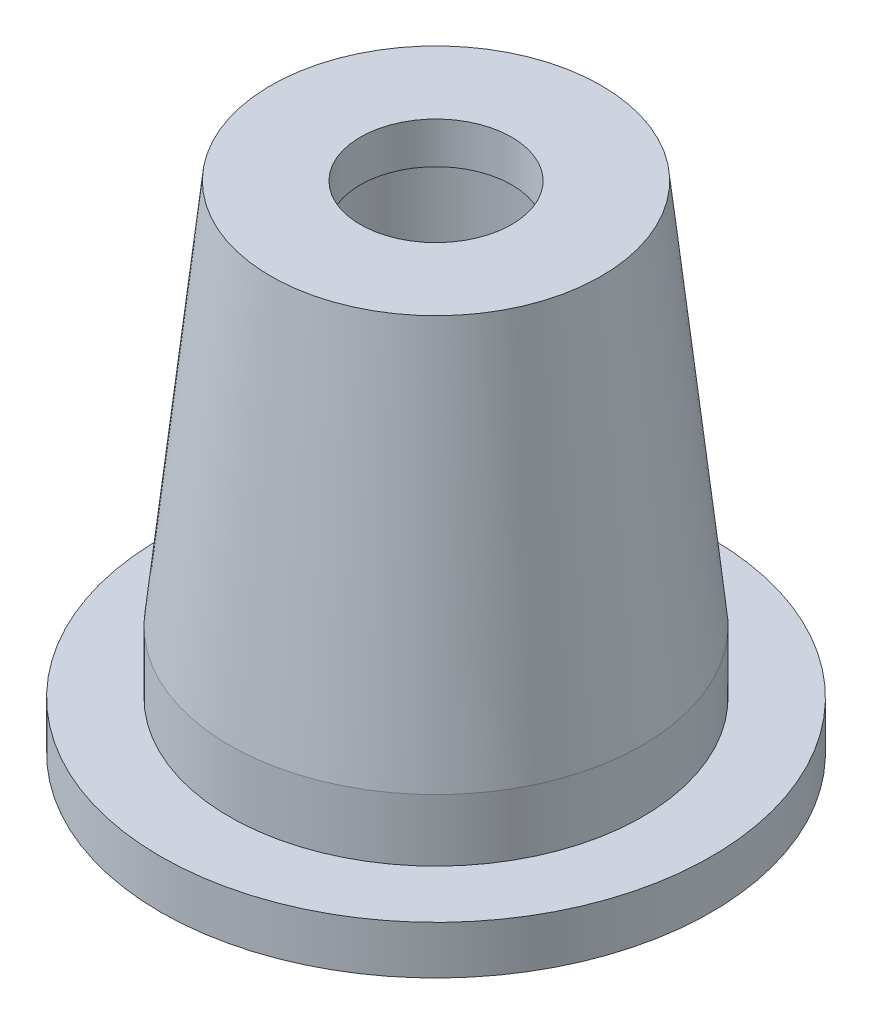
ISO-10303-21;
HEADER;
FILE_DESCRIPTION(('STEP AP214'),'2;1');
FILE_NAME('part.step','',(''),(''),'','','');
FILE_SCHEMA(('AUTOMOTIVE_DESIGN { 1 0 10303 214 1 1 1 1 }'));
ENDSEC;
DATA;
#1=APPLICATION_CONTEXT('core data for automotive mechanical design processes');
#2=APPLICATION_PROTOCOL_DEFINITION('international standard','automotive_design',2000,#1);
#3=PRODUCT_CONTEXT('',#1,'mechanical');
#4=PRODUCT('Part','Part','',(#3));
#5=PRODUCT_RELATED_PRODUCT_CATEGORY('part','',(#4));
#6=PRODUCT_DEFINITION_FORMATION('','',#4);
#7=PRODUCT_DEFINITION_CONTEXT('part definition',#1,'design');
#8=PRODUCT_DEFINITION('design','',#6,#7);
#9=PRODUCT_DEFINITION_SHAPE('','',#8);
#10=(LENGTH_UNIT() NAMED_UNIT(*) SI_UNIT(.MILLI.,.METRE.));
#11=(NAMED_UNIT(*) PLANE_ANGLE_UNIT() SI_UNIT($,.RADIAN.));
#12=(NAMED_UNIT(*) SI_UNIT($,.STERADIAN.) SOLID_ANGLE_UNIT());
#13=UNCERTAINTY_MEASURE_WITH_UNIT(LENGTH_MEASURE(1.E-05),#10,'distance_accuracy_value','');
#14=(GEOMETRIC_REPRESENTATION_CONTEXT(3) GLOBAL_UNCERTAINTY_ASSIGNED_CONTEXT((#13)) GLOBAL_UNIT_ASSIGNED_CONTEXT((#10,
#11,#12)) REPRESENTATION_CONTEXT('',''));
#15=CARTESIAN_POINT('',(0.,0.,0.));
#16=DIRECTION('',(0.,0.,1.));
#17=DIRECTION('',(1.,0.,0.));
#18=AXIS2_PLACEMENT_3D('',#15,#16,#17);
#19=CARTESIAN_POINT('',(9.00000000000001,0.,0.));
#20=DIRECTION('',(0.,-1.,0.));
#21=DIRECTION('',(0.,0.,-1.));
#22=AXIS2_PLACEMENT_3D('',#19,#20,#21);
#23=PLANE('',#22);
#24=CARTESIAN_POINT('',(0.,0.,0.));
#25=DIRECTION('',(0.,-1.,0.));
#26=DIRECTION('',(0.,0.,-1.));
#27=AXIS2_PLACEMENT_3D('',#24,#25,#26);
#28=CIRCLE('',#27,17.4364916731037);
#29=CARTESIAN_POINT('',(0.,0.,-17.4364916731037));
#30=VERTEX_POINT('',#29);
#31=EDGE_CURVE('E50',#30,#30,#28,.T.);
#32=ORIENTED_EDGE('',*,*,#31,.F.);
#33=EDGE_LOOP('',(#32));
#34=FACE_BOUND('',#33,.T.);
#35=CARTESIAN_POINT('',(0.,0.,0.));
#36=DIRECTION('',(0.,-1.,0.));
#37=DIRECTION('',(0.,0.,-1.));
#38=AXIS2_PLACEMENT_3D('',#35,#36,#37);
#39=CIRCLE('',#38,20.);
#40=CARTESIAN_POINT('',(0.,0.,-20.));
#41=VERTEX_POINT('',#40);
#42=EDGE_CURVE('E53',#41,#41,#39,.T.);
#43=ORIENTED_EDGE('',*,*,#42,.T.);
#44=EDGE_LOOP('',(#43));
#45=FACE_BOUND('',#44,.T.);
#46=ADVANCED_FACE('F32',(#34,#45),#23,.T.);
#47=CARTESIAN_POINT('',(0.,0.,0.));
#48=DIRECTION('',(0.,-1.,0.));
#49=DIRECTION('',(0.,0.,-1.));
#50=AXIS2_PLACEMENT_3D('',#47,#48,#49);
#51=CYLINDRICAL_SURFACE('',#50,20.);
#52=CARTESIAN_POINT('',(0.,3.5,0.));
#53=DIRECTION('',(0.,-1.,0.));
#54=DIRECTION('',(0.,0.,-1.));
#55=AXIS2_PLACEMENT_3D('',#52,#53,#54);
#56=CIRCLE('',#55,20.);
#57=CARTESIAN_POINT('',(0.,3.5,-20.));
#58=VERTEX_POINT('',#57);
#59=EDGE_CURVE('E43',#58,#58,#56,.T.);
#60=ORIENTED_EDGE('',*,*,#59,.T.);
#61=EDGE_LOOP('',(#60));
#62=FACE_BOUND('',#61,.T.);
#63=ORIENTED_EDGE('',*,*,#42,.F.);
#64=EDGE_LOOP('',(#63));
#65=FACE_BOUND('',#64,.T.);
#66=ADVANCED_FACE('F78',(#62,#65),#51,.T.);
#67=CARTESIAN_POINT('',(20.,3.5,0.));
#68=DIRECTION('',(0.,1.,0.));
#69=DIRECTION('',(0.,0.,1.));
#70=AXIS2_PLACEMENT_3D('',#67,#68,#69);
#71=PLANE('',#70);
#72=CARTESIAN_POINT('',(0.,3.5,0.));
#73=DIRECTION('',(0.,-1.,0.));
#74=DIRECTION('',(0.,0.,-1.));
#75=AXIS2_PLACEMENT_3D('',#72,#73,#74);
#76=CIRCLE('',#75,15.);
#77=CARTESIAN_POINT('',(0.,3.5,-15.));
#78=VERTEX_POINT('',#77);
#79=EDGE_CURVE('E47',#78,#78,#76,.T.);
#80=ORIENTED_EDGE('',*,*,#79,.T.);
#81=EDGE_LOOP('',(#80));
#82=FACE_BOUND('',#81,.T.);
#83=ORIENTED_EDGE('',*,*,#59,.F.);
#84=EDGE_LOOP('',(#83));
#85=FACE_BOUND('',#84,.T.);
#86=ADVANCED_FACE('F80',(#82,#85),#71,.T.);
#87=CARTESIAN_POINT('',(0.,0.,0.));
#88=DIRECTION('',(0.,-1.,0.));
#89=DIRECTION('',(0.,0.,-1.));
#90=AXIS2_PLACEMENT_3D('',#87,#88,#89);
#91=CYLINDRICAL_SURFACE('',#90,15.);
#92=CARTESIAN_POINT('',(0.,8.,0.));
#93=DIRECTION('',(0.,-1.,0.));
#94=DIRECTION('',(0.,0.,-1.));
#95=AXIS2_PLACEMENT_3D('',#92,#93,#94);
#96=CIRCLE('',#95,15.);
#97=CARTESIAN_POINT('',(0.,8.,-15.));
#98=VERTEX_POINT('',#97);
#99=EDGE_CURVE('E59',#98,#98,#96,.T.);
#100=ORIENTED_EDGE('',*,*,#99,.T.);
#101=EDGE_LOOP('',(#100));
#102=FACE_BOUND('',#101,.T.);
#103=ORIENTED_EDGE('',*,*,#79,.F.);
#104=EDGE_LOOP('',(#103));
#105=FACE_BOUND('',#104,.T.);
#106=ADVANCED_FACE('F86',(#102,#105),#91,.T.);
#107=CARTESIAN_POINT('',(0.,8.,0.));
#108=DIRECTION('',(0.,-1.,0.));
#109=DIRECTION('',(0.,0.,-1.));
#110=AXIS2_PLACEMENT_3D('',#107,#108,#109);
#111=CONICAL_SURFACE('',#110,15.,0.106735672649136);
#112=CARTESIAN_POINT('',(0.,36.,0.));
#113=DIRECTION('',(0.,-1.,0.));
#114=DIRECTION('',(0.,0.,-1.));
#115=AXIS2_PLACEMENT_3D('',#112,#113,#114);
#116=CIRCLE('',#115,12.);
#117=CARTESIAN_POINT('',(0.,36.,-12.));
#118=VERTEX_POINT('',#117);
#119=EDGE_CURVE('E62',#118,#118,#116,.T.);
#120=ORIENTED_EDGE('',*,*,#119,.T.);
#121=EDGE_LOOP('',(#120));
#122=FACE_BOUND('',#121,.T.);
#123=ORIENTED_EDGE('',*,*,#99,.F.);
#124=EDGE_LOOP('',(#123));
#125=FACE_BOUND('',#124,.T.);
#126=ADVANCED_FACE('F95',(#122,#125),#111,.T.);
#127=CARTESIAN_POINT('',(12.,36.,0.));
#128=DIRECTION('',(0.,1.,0.));
#129=DIRECTION('',(0.,0.,1.));
#130=AXIS2_PLACEMENT_3D('',#127,#128,#129);
#131=PLANE('',#130);
#132=CARTESIAN_POINT('',(0.,36.,0.));
#133=DIRECTION('',(0.,-1.,0.));
#134=DIRECTION('',(0.,0.,-1.));
#135=AXIS2_PLACEMENT_3D('',#132,#133,#134);
#136=CIRCLE('',#135,5.5);
#137=CARTESIAN_POINT('',(0.,36.,-5.50000000000001));
#138=VERTEX_POINT('',#137);
#139=EDGE_CURVE('E65',#138,#138,#136,.T.);
#140=ORIENTED_EDGE('',*,*,#139,.T.);
#141=EDGE_LOOP('',(#140));
#142=FACE_BOUND('',#141,.T.);
#143=ORIENTED_EDGE('',*,*,#119,.F.);
#144=EDGE_LOOP('',(#143));
#145=FACE_BOUND('',#144,.T.);
#146=ADVANCED_FACE('F99',(#142,#145),#131,.T.);
#147=CARTESIAN_POINT('',(0.,0.,0.));
#148=DIRECTION('',(0.,-1.,0.));
#149=DIRECTION('',(0.,0.,-1.));
#150=AXIS2_PLACEMENT_3D('',#147,#148,#149);
#151=CYLINDRICAL_SURFACE('',#150,5.5);
#152=CARTESIAN_POINT('',(0.,33.,0.));
#153=DIRECTION('',(0.,-1.,0.));
#154=DIRECTION('',(0.,0.,-1.));
#155=AXIS2_PLACEMENT_3D('',#152,#153,#154);
#156=CIRCLE('',#155,5.5);
#157=CARTESIAN_POINT('',(0.,33.,-5.50000000000001));
#158=VERTEX_POINT('',#157);
#159=EDGE_CURVE('E68',#158,#158,#156,.T.);
#160=ORIENTED_EDGE('',*,*,#159,.T.);
#161=EDGE_LOOP('',(#160));
#162=FACE_BOUND('',#161,.T.);
#163=ORIENTED_EDGE('',*,*,#139,.F.);
#164=EDGE_LOOP('',(#163));
#165=FACE_BOUND('',#164,.T.);
#166=ADVANCED_FACE('F103',(#162,#165),#151,.F.);
#167=CARTESIAN_POINT('',(5.50000000000002,33.,0.));
#168=DIRECTION('',(0.,-1.,0.));
#169=DIRECTION('',(0.,0.,-1.));
#170=AXIS2_PLACEMENT_3D('',#167,#168,#169);
#171=PLANE('',#170);
#172=CARTESIAN_POINT('',(0.,33.,0.));
#173=DIRECTION('',(0.,-1.,0.));
#174=DIRECTION('',(0.,0.,-1.));
#175=AXIS2_PLACEMENT_3D('',#172,#173,#174);
#176=CIRCLE('',#175,9.);
#177=CARTESIAN_POINT('',(0.,33.,-9.00000000000001));
#178=VERTEX_POINT('',#177);
#179=EDGE_CURVE('E71',#178,#178,#176,.T.);
#180=ORIENTED_EDGE('',*,*,#179,.T.);
#181=EDGE_LOOP('',(#180));
#182=FACE_BOUND('',#181,.T.);
#183=ORIENTED_EDGE('',*,*,#159,.F.);
#184=EDGE_LOOP('',(#183));
#185=FACE_BOUND('',#184,.T.);
#186=ADVANCED_FACE('F107',(#182,#185),#171,.T.);
#187=CARTESIAN_POINT('',(0.,0.,0.));
#188=DIRECTION('',(0.,-1.,0.));
#189=DIRECTION('',(0.,0.,-1.));
#190=AXIS2_PLACEMENT_3D('',#187,#188,#189);
#191=CYLINDRICAL_SURFACE('',#190,9.);
#192=CARTESIAN_POINT('',(0.,3.00000000000001,0.));
#193=DIRECTION('',(0.,-1.,0.));
#194=DIRECTION('',(0.,0.,-1.));
#195=AXIS2_PLACEMENT_3D('',#192,#193,#194);
#196=CIRCLE('',#195,9.);
#197=CARTESIAN_POINT('',(0.,3.00000000000001,-9.00000000000001));
#198=VERTEX_POINT('',#197);
#199=EDGE_CURVE('E39',#198,#198,#196,.T.);
#200=ORIENTED_EDGE('',*,*,#199,.T.);
#201=EDGE_LOOP('',(#200));
#202=FACE_BOUND('',#201,.T.);
#203=ORIENTED_EDGE('',*,*,#179,.F.);
#204=EDGE_LOOP('',(#203));
#205=FACE_BOUND('',#204,.T.);
#206=ADVANCED_FACE('F111',(#202,#205),#191,.F.);
#207=CARTESIAN_POINT('',(0.,0.,0.));
#208=DIRECTION('',(0.,-1.,0.));
#209=DIRECTION('',(0.,0.,-1.));
#210=AXIS2_PLACEMENT_3D('',#207,#208,#209);
#211=CIRCLE('',#210,12.);
#212=CARTESIAN_POINT('',(0.,0.,-12.));
#213=VERTEX_POINT('',#212);
#214=EDGE_CURVE('E10',#213,#213,#211,.F.);
#215=ORIENTED_EDGE('',*,*,#214,.T.);
#216=EDGE_LOOP('',(#215));
#217=FACE_BOUND('',#216,.T.);
#218=CARTESIAN_POINT('',(0.,0.,0.));
#219=DIRECTION('',(0.,1.,0.));
#220=DIRECTION('',(0.,0.,1.));
#221=AXIS2_PLACEMENT_3D('',#218,#219,#220);
#222=CIRCLE('',#221,13.5635083268963);
#223=CARTESIAN_POINT('',(0.,0.,13.5635083268963));
#224=VERTEX_POINT('',#223);
#225=EDGE_CURVE('E54',#224,#224,#222,.T.);
#226=ORIENTED_EDGE('',*,*,#225,.F.);
#227=EDGE_LOOP('',(#226));
#228=FACE_BOUND('',#227,.T.);
#229=ADVANCED_FACE('F91',(#217,#228),#23,.T.);
#230=CARTESIAN_POINT('',(0.,-0.5,0.));
#231=DIRECTION('',(0.,-1.,0.));
#232=DIRECTION('',(0.,0.,-1.));
#233=AXIS2_PLACEMENT_3D('',#230,#231,#232);
#234=TOROIDAL_SURFACE('',#233,15.5,2.);
#235=ORIENTED_EDGE('',*,*,#31,.T.);
#236=EDGE_LOOP('',(#235));
#237=FACE_BOUND('',#236,.T.);
#238=ORIENTED_EDGE('',*,*,#225,.T.);
#239=EDGE_LOOP('',(#238));
#240=FACE_BOUND('',#239,.T.);
#241=ADVANCED_FACE('F116',(#237,#240),#234,.F.);
#242=CARTESIAN_POINT('',(0.,3.00000000000001,0.));
#243=DIRECTION('',(0.,-1.,0.));
#244=DIRECTION('',(0.,0.,-1.));
#245=AXIS2_PLACEMENT_3D('',#242,#243,#244);
#246=CONICAL_SURFACE('',#245,9.,0.78539816339745);
#247=ORIENTED_EDGE('',*,*,#214,.F.);
#248=EDGE_LOOP('',(#247));
#249=FACE_BOUND('',#248,.T.);
#250=ORIENTED_EDGE('',*,*,#199,.F.);
#251=EDGE_LOOP('',(#250));
#252=FACE_BOUND('',#251,.T.);
#253=ADVANCED_FACE('F34',(#249,#252),#246,.F.);
#254=CLOSED_SHELL('',(#46,#66,#86,#106,#126,#146,#166,#186,#206,#229,#241,#253));
#255=MANIFOLD_SOLID_BREP('B2',#254);
#256=ADVANCED_BREP_SHAPE_REPRESENTATION('',(#18,#255),#14);
#257=SHAPE_DEFINITION_REPRESENTATION(#9,#256);
ENDSEC;
END-ISO-10303-21;
